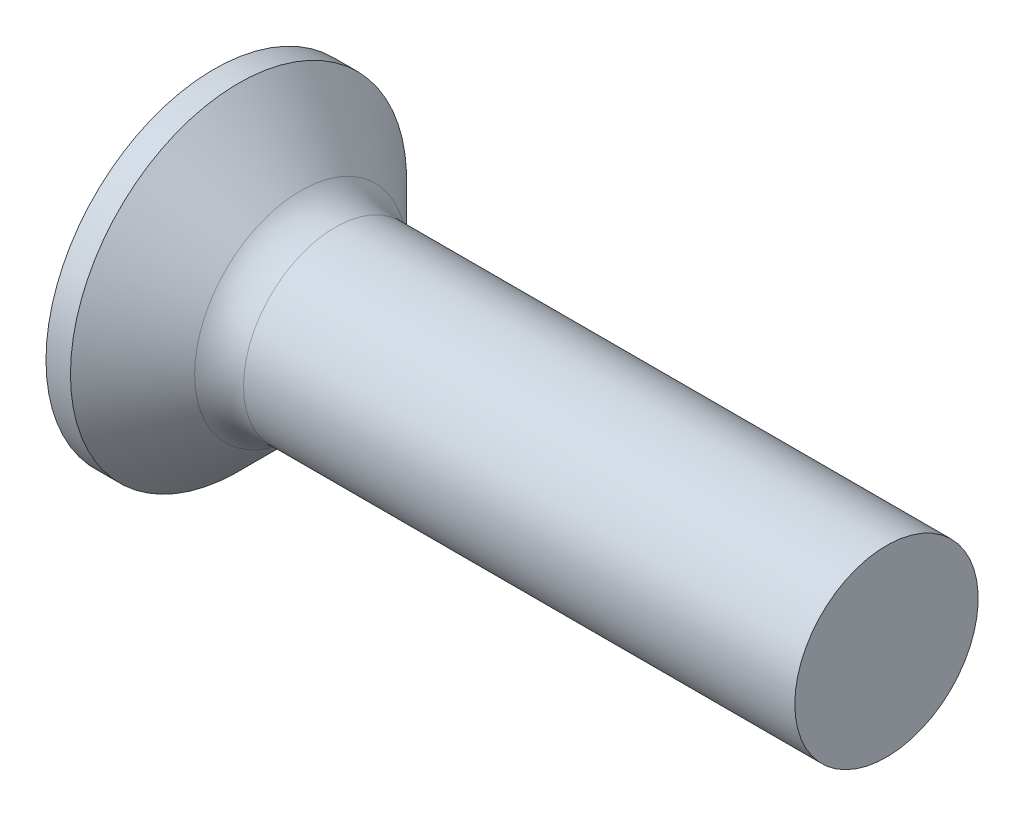
ISO-10303-21;
HEADER;
FILE_DESCRIPTION(('STEP AP214'),'2;1');
FILE_NAME('part.step','',(''),(''),'','','');
FILE_SCHEMA(('AUTOMOTIVE_DESIGN { 1 0 10303 214 1 1 1 1 }'));
ENDSEC;
DATA;
#1=APPLICATION_CONTEXT('core data for automotive mechanical design processes');
#2=APPLICATION_PROTOCOL_DEFINITION('international standard','automotive_design',2000,#1);
#3=PRODUCT_CONTEXT('',#1,'mechanical');
#4=PRODUCT('Part','Part','',(#3));
#5=PRODUCT_RELATED_PRODUCT_CATEGORY('part','',(#4));
#6=PRODUCT_DEFINITION_FORMATION('','',#4);
#7=PRODUCT_DEFINITION_CONTEXT('part definition',#1,'design');
#8=PRODUCT_DEFINITION('design','',#6,#7);
#9=PRODUCT_DEFINITION_SHAPE('','',#8);
#10=(LENGTH_UNIT() NAMED_UNIT(*) SI_UNIT(.MILLI.,.METRE.));
#11=(NAMED_UNIT(*) PLANE_ANGLE_UNIT() SI_UNIT($,.RADIAN.));
#12=(NAMED_UNIT(*) SI_UNIT($,.STERADIAN.) SOLID_ANGLE_UNIT());
#13=UNCERTAINTY_MEASURE_WITH_UNIT(LENGTH_MEASURE(1.E-05),#10,'distance_accuracy_value','');
#14=(GEOMETRIC_REPRESENTATION_CONTEXT(3) GLOBAL_UNCERTAINTY_ASSIGNED_CONTEXT((#13)) GLOBAL_UNIT_ASSIGNED_CONTEXT((#10,
#11,#12)) REPRESENTATION_CONTEXT('',''));
#15=CARTESIAN_POINT('',(0.,0.,0.));
#16=DIRECTION('',(0.,0.,1.));
#17=DIRECTION('',(1.,0.,0.));
#18=AXIS2_PLACEMENT_3D('',#15,#16,#17);
#19=CARTESIAN_POINT('',(2.01,-0.497851135403458,0.37));
#20=DIRECTION('',(0.,0.,-1.));
#21=DIRECTION('',(0.,1.,0.));
#22=AXIS2_PLACEMENT_3D('',#19,#20,#21);
#23=PLANE('',#22);
#24=DIRECTION('',(0.,-1.,0.));
#25=VECTOR('',#24,1.);
#26=CARTESIAN_POINT('',(0.,1.5,0.37));
#27=LINE('',#26,#25);
#28=CARTESIAN_POINT('',(0.,-0.590157547916263,0.37));
#29=VERTEX_POINT('',#28);
#30=CARTESIAN_POINT('',(0.,-1.5,0.37));
#31=VERTEX_POINT('',#30);
#32=EDGE_CURVE('E452',#29,#31,#27,.T.);
#33=ORIENTED_EDGE('',*,*,#32,.F.);
#34=CARTESIAN_POINT('',(-1.01053649691082,-0.672102030072118,0.37));
#35=CARTESIAN_POINT('',(-0.79970605871103,-0.655267098883947,0.37));
#36=CARTESIAN_POINT('',(-0.588886212503304,-0.638297110572311,0.37));
#37=CARTESIAN_POINT('',(-0.167272662529611,-0.603984130519828,0.37));
#38=CARTESIAN_POINT('',(0.0435210406290472,-0.586641131324258,0.37));
#39=CARTESIAN_POINT('',(0.465068838244709,-0.551479911667385,0.37));
#40=CARTESIAN_POINT('',(0.67582293271526,-0.533661691368909,0.37));
#41=CARTESIAN_POINT('',(1.09727362083221,-0.497387538872971,0.37));
#42=CARTESIAN_POINT('',(1.30797021521736,-0.478931615299089,0.37));
#43=CARTESIAN_POINT('',(1.67418894757201,-0.446067164121906,0.37));
#44=CARTESIAN_POINT('',(1.82972932585734,-0.431862501028414,0.37));
#45=CARTESIAN_POINT('',(2.14074770359484,-0.40279770973988,0.37));
#46=CARTESIAN_POINT('',(2.29622570356215,-0.38793758707517,0.37));
#47=CARTESIAN_POINT('',(2.60710169348415,-0.357305117937677,0.37));
#48=CARTESIAN_POINT('',(2.76249967840253,-0.34153271979064,0.37));
#49=CARTESIAN_POINT('',(2.99549070742189,-0.316847908281595,0.37));
#50=CARTESIAN_POINT('',(3.07313791118864,-0.308448465897182,0.37));
#51=CARTESIAN_POINT('',(3.22838341575769,-0.29120225104834,0.37));
#52=CARTESIAN_POINT('',(3.30598171599396,-0.282355473499083,0.37));
#53=CARTESIAN_POINT('',(3.38354828463398,-0.273232461289951,0.37));
#54=B_SPLINE_CURVE_WITH_KNOTS('',3,(#34,#35,#36,#37,#38,#39,#40,#41,#42,#43,#44,#45,#46,#47,#48,
#49,#50,#51,#52,#53),.UNSPECIFIED.,.F.,.F.,(4,2,2,2,2,2,2,2,2,4),(0.,0.634504777554397,
1.26902224766093,1.90353950036111,2.53804817592041,3.00661008438666,3.47516804019383,
3.94375256268972,4.17805198331268,4.41235406779909),.UNSPECIFIED.);
#55=CARTESIAN_POINT('',(2.01,-0.415013252800437,0.37));
#56=VERTEX_POINT('',#55);
#57=EDGE_CURVE('E215',#29,#56,#54,.T.);
#58=ORIENTED_EDGE('',*,*,#57,.T.);
#59=DIRECTION('',(0.,-1.,0.));
#60=VECTOR('',#59,1.);
#61=CARTESIAN_POINT('',(2.01,0.497851135403459,0.37));
#62=LINE('',#61,#60);
#63=CARTESIAN_POINT('',(2.01,-0.497851135403458,0.37));
#64=VERTEX_POINT('',#63);
#65=EDGE_CURVE('E361',#56,#64,#62,.T.);
#66=ORIENTED_EDGE('',*,*,#65,.T.);
#67=DIRECTION('',(0.894934391398442,0.446197753347436,0.));
#68=VECTOR('',#67,1.);
#69=CARTESIAN_POINT('',(0.,-1.5,0.37));
#70=LINE('',#69,#68);
#71=EDGE_CURVE('E460',#31,#64,#70,.T.);
#72=ORIENTED_EDGE('',*,*,#71,.F.);
#73=EDGE_LOOP('',(#33,#58,#66,#72));
#74=FACE_BOUND('',#73,.T.);
#75=ADVANCED_FACE('F37',(#74),#23,.T.);
#76=CARTESIAN_POINT('',(2.01,0.497851135403459,0.37));
#77=VERTEX_POINT('',#76);
#78=CARTESIAN_POINT('',(2.01,0.415013252800437,0.37));
#79=VERTEX_POINT('',#78);
#80=EDGE_CURVE('E357',#77,#79,#62,.T.);
#81=ORIENTED_EDGE('',*,*,#80,.T.);
#82=CARTESIAN_POINT('',(-1.01053649699026,0.672102030078459,0.37));
#83=CARTESIAN_POINT('',(-0.799706058781648,0.65526709888962,0.37));
#84=CARTESIAN_POINT('',(-0.588886212565099,0.638297110577309,0.37));
#85=CARTESIAN_POINT('',(-0.167272662573758,0.603984130523453,0.37));
#86=CARTESIAN_POINT('',(0.043521040593722,0.586641131327185,0.37));
#87=CARTESIAN_POINT('',(0.465068838236453,0.551479911668094,0.37));
#88=CARTESIAN_POINT('',(0.675822932725248,0.533661691368078,0.37));
#89=CARTESIAN_POINT('',(1.09727362087867,0.497387538868943,0.37));
#90=CARTESIAN_POINT('',(1.30797021528206,0.478931615293404,0.37));
#91=CARTESIAN_POINT('',(1.67418894765493,0.446067164114376,0.37));
#92=CARTESIAN_POINT('',(1.82972932594025,0.431862501020785,0.37));
#93=CARTESIAN_POINT('',(2.14074770367772,0.402797709732016,0.37));
#94=CARTESIAN_POINT('',(2.29622570364503,0.38793758706717,0.37));
#95=CARTESIAN_POINT('',(2.60710169356699,0.357305117929346,0.37));
#96=CARTESIAN_POINT('',(2.76249967848536,0.341532719782116,0.37));
#97=CARTESIAN_POINT('',(2.99549070750468,0.316847908272698,0.37));
#98=CARTESIAN_POINT('',(3.07313791127142,0.308448465888148,0.37));
#99=CARTESIAN_POINT('',(3.22838341584044,0.291202251038989,0.37));
#100=CARTESIAN_POINT('',(3.30598171607669,0.282355473489554,0.37));
#101=CARTESIAN_POINT('',(3.38354828471668,0.273232461280216,0.37));
#102=B_SPLINE_CURVE_WITH_KNOTS('',3,(#82,#83,#84,#85,#86,#87,#88,#89,#90,#91,#92,#93,#94,#95,
#96,#97,#98,#99,#100,#101),.UNSPECIFIED.,.F.,.F.,(4,2,2,2,2,2,2,2,2,4),(0.,0.634504777580945,
1.26902224771403,1.90353950046914,2.53804817608336,3.00661008454961,3.47516804035678,
3.94375256285268,4.17805198347564,4.41235406796206),.UNSPECIFIED.);
#103=CARTESIAN_POINT('',(0.,0.590157547916263,0.37));
#104=VERTEX_POINT('',#103);
#105=EDGE_CURVE('E209',#79,#104,#102,.F.);
#106=ORIENTED_EDGE('',*,*,#105,.T.);
#107=CARTESIAN_POINT('',(0.,1.5,0.37));
#108=VERTEX_POINT('',#107);
#109=EDGE_CURVE('E454',#108,#104,#27,.T.);
#110=ORIENTED_EDGE('',*,*,#109,.F.);
#111=DIRECTION('',(0.894934391398442,-0.446197753347436,0.));
#112=VECTOR('',#111,1.);
#113=CARTESIAN_POINT('',(0.,1.5,0.37));
#114=LINE('',#113,#112);
#115=EDGE_CURVE('E60',#108,#77,#114,.T.);
#116=ORIENTED_EDGE('',*,*,#115,.T.);
#117=EDGE_LOOP('',(#81,#106,#110,#116));
#118=FACE_BOUND('',#117,.T.);
#119=ADVANCED_FACE('F191',(#118),#23,.T.);
#120=CARTESIAN_POINT('',(2.01,0.497851135403458,-0.37));
#121=DIRECTION('',(0.,0.,1.));
#122=DIRECTION('',(1.,0.,0.));
#123=AXIS2_PLACEMENT_3D('',#120,#121,#122);
#124=PLANE('',#123);
#125=DIRECTION('',(0.,1.,0.));
#126=VECTOR('',#125,1.);
#127=CARTESIAN_POINT('',(2.01,-0.497851135403458,-0.37));
#128=LINE('',#127,#126);
#129=CARTESIAN_POINT('',(2.01,-0.497851135403458,-0.37));
#130=VERTEX_POINT('',#129);
#131=CARTESIAN_POINT('',(2.01,-0.415013252800437,-0.37));
#132=VERTEX_POINT('',#131);
#133=EDGE_CURVE('E370',#130,#132,#128,.T.);
#134=ORIENTED_EDGE('',*,*,#133,.T.);
#135=CARTESIAN_POINT('',(-1.01053649691082,-0.672102030072118,-0.37));
#136=CARTESIAN_POINT('',(-0.79970605871103,-0.655267098883947,-0.37));
#137=CARTESIAN_POINT('',(-0.588886212503305,-0.638297110572311,-0.37));
#138=CARTESIAN_POINT('',(-0.16727266252961,-0.603984130519828,-0.37));
#139=CARTESIAN_POINT('',(0.0435210406290472,-0.586641131324259,-0.37));
#140=CARTESIAN_POINT('',(0.465068838244709,-0.551479911667385,-0.37));
#141=CARTESIAN_POINT('',(0.67582293271526,-0.533661691368909,-0.37));
#142=CARTESIAN_POINT('',(1.09727362083221,-0.497387538872971,-0.37));
#143=CARTESIAN_POINT('',(1.30797021521736,-0.47893161529909,-0.37));
#144=CARTESIAN_POINT('',(1.67418894757201,-0.446067164121906,-0.37));
#145=CARTESIAN_POINT('',(1.82972932585734,-0.431862501028414,-0.37));
#146=CARTESIAN_POINT('',(2.14074770359484,-0.40279770973988,-0.37));
#147=CARTESIAN_POINT('',(2.29622570356215,-0.38793758707517,-0.37));
#148=CARTESIAN_POINT('',(2.60710169348415,-0.357305117937677,-0.37));
#149=CARTESIAN_POINT('',(2.76249967840254,-0.34153271979064,-0.37));
#150=CARTESIAN_POINT('',(2.99549070742189,-0.316847908281595,-0.37));
#151=CARTESIAN_POINT('',(3.07313791118864,-0.308448465897182,-0.37));
#152=CARTESIAN_POINT('',(3.22838341575769,-0.29120225104834,-0.37));
#153=CARTESIAN_POINT('',(3.30598171599396,-0.282355473499083,-0.37));
#154=CARTESIAN_POINT('',(3.38354828463398,-0.273232461289951,-0.37));
#155=B_SPLINE_CURVE_WITH_KNOTS('',3,(#135,#136,#137,#138,#139,#140,#141,#142,#143,#144,#145,
#146,#147,#148,#149,#150,#151,#152,#153,#154),.UNSPECIFIED.,.F.,.F.,(4,2,2,2,2,2,2,2,2,4),(0.,
0.634504777554397,1.26902224766093,1.90353950036111,2.53804817592041,3.00661008438666,
3.47516804019383,3.94375256268973,4.17805198331268,4.41235406779909),.UNSPECIFIED.);
#156=CARTESIAN_POINT('',(0.,-0.590157547916263,-0.37));
#157=VERTEX_POINT('',#156);
#158=EDGE_CURVE('E265',#132,#157,#155,.F.);
#159=ORIENTED_EDGE('',*,*,#158,.T.);
#160=DIRECTION('',(0.,1.,0.));
#161=VECTOR('',#160,1.);
#162=CARTESIAN_POINT('',(0.,-1.5,-0.37));
#163=LINE('',#162,#161);
#164=CARTESIAN_POINT('',(0.,-1.5,-0.37));
#165=VERTEX_POINT('',#164);
#166=EDGE_CURVE('E453',#165,#157,#163,.T.);
#167=ORIENTED_EDGE('',*,*,#166,.F.);
#168=DIRECTION('',(0.894934391398442,0.446197753347436,0.));
#169=VECTOR('',#168,1.);
#170=CARTESIAN_POINT('',(0.,-1.5,-0.37));
#171=LINE('',#170,#169);
#172=EDGE_CURVE('E463',#165,#130,#171,.T.);
#173=ORIENTED_EDGE('',*,*,#172,.T.);
#174=EDGE_LOOP('',(#134,#159,#167,#173));
#175=FACE_BOUND('',#174,.T.);
#176=ADVANCED_FACE('F197',(#175),#124,.T.);
#177=CARTESIAN_POINT('',(0.,0.590157547916263,-0.37));
#178=VERTEX_POINT('',#177);
#179=CARTESIAN_POINT('',(0.,1.5,-0.37));
#180=VERTEX_POINT('',#179);
#181=EDGE_CURVE('E459',#178,#180,#163,.T.);
#182=ORIENTED_EDGE('',*,*,#181,.F.);
#183=CARTESIAN_POINT('',(-1.01053649691082,0.672102030072118,-0.37));
#184=CARTESIAN_POINT('',(-0.79970605871103,0.655267098883947,-0.37));
#185=CARTESIAN_POINT('',(-0.588886212503304,0.638297110572311,-0.37));
#186=CARTESIAN_POINT('',(-0.16727266252961,0.603984130519828,-0.37));
#187=CARTESIAN_POINT('',(0.0435210406290473,0.586641131324259,-0.37));
#188=CARTESIAN_POINT('',(0.465068838244709,0.551479911667385,-0.37));
#189=CARTESIAN_POINT('',(0.67582293271526,0.533661691368909,-0.37));
#190=CARTESIAN_POINT('',(1.09727362083221,0.497387538872971,-0.37));
#191=CARTESIAN_POINT('',(1.30797021521736,0.478931615299089,-0.37));
#192=CARTESIAN_POINT('',(1.67418894757201,0.446067164121906,-0.37));
#193=CARTESIAN_POINT('',(1.82972932585734,0.431862501028415,-0.37));
#194=CARTESIAN_POINT('',(2.14074770359484,0.40279770973988,-0.37));
#195=CARTESIAN_POINT('',(2.29622570356215,0.38793758707517,-0.37));
#196=CARTESIAN_POINT('',(2.60710169348415,0.357305117937677,-0.37));
#197=CARTESIAN_POINT('',(2.76249967840253,0.34153271979064,-0.37));
#198=CARTESIAN_POINT('',(2.99549070742189,0.316847908281595,-0.37));
#199=CARTESIAN_POINT('',(3.07313791118864,0.308448465897183,-0.37));
#200=CARTESIAN_POINT('',(3.22838341575769,0.29120225104834,-0.37));
#201=CARTESIAN_POINT('',(3.30598171599396,0.282355473499083,-0.37));
#202=CARTESIAN_POINT('',(3.38354828463398,0.273232461289951,-0.37));
#203=B_SPLINE_CURVE_WITH_KNOTS('',3,(#183,#184,#185,#186,#187,#188,#189,#190,#191,#192,#193,
#194,#195,#196,#197,#198,#199,#200,#201,#202),.UNSPECIFIED.,.F.,.F.,(4,2,2,2,2,2,2,2,2,4),(0.,
0.634504777554397,1.26902224766093,1.90353950036111,2.53804817592041,3.00661008438666,
3.47516804019383,3.94375256268972,4.17805198331267,4.41235406779909),.UNSPECIFIED.);
#204=CARTESIAN_POINT('',(2.01,0.415013252800437,-0.37));
#205=VERTEX_POINT('',#204);
#206=EDGE_CURVE('E260',#178,#205,#203,.T.);
#207=ORIENTED_EDGE('',*,*,#206,.T.);
#208=CARTESIAN_POINT('',(2.01,0.497851135403459,-0.37));
#209=VERTEX_POINT('',#208);
#210=EDGE_CURVE('E372',#205,#209,#128,.T.);
#211=ORIENTED_EDGE('',*,*,#210,.T.);
#212=DIRECTION('',(0.894934391398442,-0.446197753347436,0.));
#213=VECTOR('',#212,1.);
#214=CARTESIAN_POINT('',(0.,1.5,-0.37));
#215=LINE('',#214,#213);
#216=EDGE_CURVE('E369',#180,#209,#215,.T.);
#217=ORIENTED_EDGE('',*,*,#216,.F.);
#218=EDGE_LOOP('',(#182,#207,#211,#217));
#219=FACE_BOUND('',#218,.T.);
#220=ADVANCED_FACE('F470',(#219),#124,.T.);
#221=CARTESIAN_POINT('',(2.01,0.497851135403459,-0.37));
#222=DIRECTION('',(1.,0.,0.));
#223=DIRECTION('',(0.,0.,-1.));
#224=AXIS2_PLACEMENT_3D('',#221,#222,#223);
#225=PLANE('',#224);
#226=CARTESIAN_POINT('',(2.01,0.,0.));
#227=DIRECTION('',(-1.,0.,0.));
#228=DIRECTION('',(0.,0.,1.));
#229=AXIS2_PLACEMENT_3D('',#226,#227,#228);
#230=CIRCLE('',#229,0.555999999999999);
#231=CARTESIAN_POINT('',(2.01,-0.24754847399547,-0.497851135403459));
#232=VERTEX_POINT('',#231);
#233=CARTESIAN_POINT('',(2.01,-0.369999999999999,-0.415013252800438));
#234=VERTEX_POINT('',#233);
#235=EDGE_CURVE('E336',#232,#234,#230,.T.);
#236=ORIENTED_EDGE('',*,*,#235,.F.);
#237=DIRECTION('',(0.,1.,0.));
#238=VECTOR('',#237,1.);
#239=CARTESIAN_POINT('',(2.01,-0.369999999999998,-0.49785113540346));
#240=LINE('',#239,#238);
#241=CARTESIAN_POINT('',(2.01,-0.369999999999998,-0.49785113540346));
#242=VERTEX_POINT('',#241);
#243=EDGE_CURVE('E437',#242,#232,#240,.T.);
#244=ORIENTED_EDGE('',*,*,#243,.F.);
#245=DIRECTION('',(0.,0.,-1.));
#246=VECTOR('',#245,1.);
#247=CARTESIAN_POINT('',(2.01,-0.370000000000002,0.497851135403457));
#248=LINE('',#247,#246);
#249=EDGE_CURVE('E441',#234,#242,#248,.T.);
#250=ORIENTED_EDGE('',*,*,#249,.F.);
#251=EDGE_LOOP('',(#236,#244,#250));
#252=FACE_BOUND('',#251,.T.);
#253=ADVANCED_FACE('F483',(#252),#225,.F.);
#254=CARTESIAN_POINT('',(2.01,-0.497851135403458,-0.247548473995472));
#255=VERTEX_POINT('',#254);
#256=EDGE_CURVE('E331',#132,#255,#230,.T.);
#257=ORIENTED_EDGE('',*,*,#256,.F.);
#258=ORIENTED_EDGE('',*,*,#133,.F.);
#259=DIRECTION('',(0.,0.,-1.));
#260=VECTOR('',#259,1.);
#261=CARTESIAN_POINT('',(2.01,-0.497851135403458,0.37));
#262=LINE('',#261,#260);
#263=EDGE_CURVE('E360',#255,#130,#262,.T.);
#264=ORIENTED_EDGE('',*,*,#263,.F.);
#265=EDGE_LOOP('',(#257,#258,#264));
#266=FACE_BOUND('',#265,.T.);
#267=ADVANCED_FACE('F489',(#266),#225,.F.);
#268=CARTESIAN_POINT('',(2.01,-0.497851135403458,0.247548473995472));
#269=VERTEX_POINT('',#268);
#270=EDGE_CURVE('E326',#269,#56,#230,.T.);
#271=ORIENTED_EDGE('',*,*,#270,.F.);
#272=EDGE_CURVE('E363',#64,#269,#262,.T.);
#273=ORIENTED_EDGE('',*,*,#272,.F.);
#274=ORIENTED_EDGE('',*,*,#65,.F.);
#275=EDGE_LOOP('',(#271,#273,#274));
#276=FACE_BOUND('',#275,.T.);
#277=ADVANCED_FACE('F495',(#276),#225,.F.);
#278=CARTESIAN_POINT('',(2.01,-0.370000000000001,0.415013252800436));
#279=VERTEX_POINT('',#278);
#280=CARTESIAN_POINT('',(2.01,-0.247548473995473,0.497851135403458));
#281=VERTEX_POINT('',#280);
#282=EDGE_CURVE('E52',#279,#281,#230,.T.);
#283=ORIENTED_EDGE('',*,*,#282,.F.);
#284=CARTESIAN_POINT('',(2.01,-0.370000000000002,0.497851135403457));
#285=VERTEX_POINT('',#284);
#286=EDGE_CURVE('E443',#285,#279,#248,.T.);
#287=ORIENTED_EDGE('',*,*,#286,.F.);
#288=DIRECTION('',(0.,-1.,0.));
#289=VECTOR('',#288,1.);
#290=CARTESIAN_POINT('',(2.01,0.369999999999998,0.49785113540346));
#291=LINE('',#290,#289);
#292=EDGE_CURVE('E442',#281,#285,#291,.T.);
#293=ORIENTED_EDGE('',*,*,#292,.F.);
#294=EDGE_LOOP('',(#283,#287,#293));
#295=FACE_BOUND('',#294,.T.);
#296=ADVANCED_FACE('F522',(#295),#225,.F.);
#297=CARTESIAN_POINT('',(2.01,0.24754847399547,0.497851135403459));
#298=VERTEX_POINT('',#297);
#299=CARTESIAN_POINT('',(2.01,0.369999999999999,0.415013252800438));
#300=VERTEX_POINT('',#299);
#301=EDGE_CURVE('E317',#298,#300,#230,.T.);
#302=ORIENTED_EDGE('',*,*,#301,.F.);
#303=CARTESIAN_POINT('',(2.01,0.369999999999998,0.49785113540346));
#304=VERTEX_POINT('',#303);
#305=EDGE_CURVE('E438',#304,#298,#291,.T.);
#306=ORIENTED_EDGE('',*,*,#305,.F.);
#307=DIRECTION('',(0.,0.,1.));
#308=VECTOR('',#307,1.);
#309=CARTESIAN_POINT('',(2.01,0.370000000000002,-0.497851135403457));
#310=LINE('',#309,#308);
#311=EDGE_CURVE('E221',#300,#304,#310,.T.);
#312=ORIENTED_EDGE('',*,*,#311,.F.);
#313=EDGE_LOOP('',(#302,#306,#312));
#314=FACE_BOUND('',#313,.T.);
#315=ADVANCED_FACE('F479',(#314),#225,.F.);
#316=CARTESIAN_POINT('',(2.01,0.497851135403459,0.247548473995472));
#317=VERTEX_POINT('',#316);
#318=EDGE_CURVE('E324',#79,#317,#230,.T.);
#319=ORIENTED_EDGE('',*,*,#318,.F.);
#320=ORIENTED_EDGE('',*,*,#80,.F.);
#321=DIRECTION('',(0.,0.,1.));
#322=VECTOR('',#321,1.);
#323=CARTESIAN_POINT('',(2.01,0.497851135403459,-0.37));
#324=LINE('',#323,#322);
#325=EDGE_CURVE('E358',#317,#77,#324,.T.);
#326=ORIENTED_EDGE('',*,*,#325,.F.);
#327=EDGE_LOOP('',(#319,#320,#326));
#328=FACE_BOUND('',#327,.T.);
#329=ADVANCED_FACE('F356',(#328),#225,.F.);
#330=CARTESIAN_POINT('',(2.01,0.497851135403459,-0.247548473995472));
#331=VERTEX_POINT('',#330);
#332=EDGE_CURVE('E346',#331,#205,#230,.T.);
#333=ORIENTED_EDGE('',*,*,#332,.F.);
#334=EDGE_CURVE('E365',#209,#331,#324,.T.);
#335=ORIENTED_EDGE('',*,*,#334,.F.);
#336=ORIENTED_EDGE('',*,*,#210,.F.);
#337=EDGE_LOOP('',(#333,#335,#336));
#338=FACE_BOUND('',#337,.T.);
#339=ADVANCED_FACE('F472',(#338),#225,.F.);
#340=CARTESIAN_POINT('',(2.01,-0.497851135403458,-0.37));
#341=DIRECTION('',(-0.446197753347436,0.894934391398443,0.));
#342=DIRECTION('',(-0.894934391398442,-0.446197753347436,0.));
#343=AXIS2_PLACEMENT_3D('',#340,#341,#342);
#344=PLANE('',#343);
#345=ORIENTED_EDGE('',*,*,#272,.T.);
#346=CARTESIAN_POINT('',(2.86902919914418,-0.0695550475538963,0.));
#347=DIRECTION('',(-0.446197753347436,0.894934391398443,0.));
#348=DIRECTION('',(-0.894934391398443,-0.446197753347436,0.));
#349=AXIS2_PLACEMENT_3D('',#346,#347,#348);
#350=ELLIPSE('',#349,1.11145971268776,0.491029001453358);
#351=EDGE_CURVE('E276',#269,#255,#350,.F.);
#352=ORIENTED_EDGE('',*,*,#351,.T.);
#353=ORIENTED_EDGE('',*,*,#263,.T.);
#354=ORIENTED_EDGE('',*,*,#172,.F.);
#355=DIRECTION('',(0.,0.,-1.));
#356=VECTOR('',#355,1.);
#357=CARTESIAN_POINT('',(0.,-1.5,0.37));
#358=LINE('',#357,#356);
#359=EDGE_CURVE('E377',#31,#165,#358,.T.);
#360=ORIENTED_EDGE('',*,*,#359,.F.);
#361=ORIENTED_EDGE('',*,*,#71,.T.);
#362=EDGE_LOOP('',(#345,#352,#353,#354,#360,#361));
#363=FACE_BOUND('',#362,.T.);
#364=ADVANCED_FACE('F203',(#363),#344,.T.);
#365=CARTESIAN_POINT('',(2.01,0.497851135403459,0.37));
#366=DIRECTION('',(-0.446197753347436,-0.894934391398443,0.));
#367=DIRECTION('',(0.894934391398442,-0.446197753347436,0.));
#368=AXIS2_PLACEMENT_3D('',#365,#366,#367);
#369=PLANE('',#368);
#370=ORIENTED_EDGE('',*,*,#334,.T.);
#371=CARTESIAN_POINT('',(2.86902919914418,0.0695550475538964,0.));
#372=DIRECTION('',(-0.446197753347436,-0.894934391398443,0.));
#373=DIRECTION('',(-0.894934391398443,0.446197753347436,0.));
#374=AXIS2_PLACEMENT_3D('',#371,#372,#373);
#375=ELLIPSE('',#374,1.11145971268776,0.491029001453358);
#376=EDGE_CURVE('E281',#331,#317,#375,.F.);
#377=ORIENTED_EDGE('',*,*,#376,.T.);
#378=ORIENTED_EDGE('',*,*,#325,.T.);
#379=ORIENTED_EDGE('',*,*,#115,.F.);
#380=DIRECTION('',(0.,0.,1.));
#381=VECTOR('',#380,1.);
#382=CARTESIAN_POINT('',(0.,1.5,-0.37));
#383=LINE('',#382,#381);
#384=EDGE_CURVE('E449',#180,#108,#383,.T.);
#385=ORIENTED_EDGE('',*,*,#384,.F.);
#386=ORIENTED_EDGE('',*,*,#216,.T.);
#387=EDGE_LOOP('',(#370,#377,#378,#379,#385,#386));
#388=FACE_BOUND('',#387,.T.);
#389=ADVANCED_FACE('F468',(#388),#369,.T.);
#390=CARTESIAN_POINT('',(2.01,0.369999999999998,0.497851135403459));
#391=DIRECTION('',(0.,-1.,0.));
#392=DIRECTION('',(1.,0.,0.));
#393=AXIS2_PLACEMENT_3D('',#390,#391,#392);
#394=PLANE('',#393);
#395=CARTESIAN_POINT('',(2.01,0.370000000000002,-0.497851135403457));
#396=VERTEX_POINT('',#395);
#397=CARTESIAN_POINT('',(2.01,0.370000000000001,-0.415013252800436));
#398=VERTEX_POINT('',#397);
#399=EDGE_CURVE('E447',#396,#398,#310,.T.);
#400=ORIENTED_EDGE('',*,*,#399,.T.);
#401=CARTESIAN_POINT('',(-1.01053649699026,0.370000000000002,-0.672102030078458));
#402=CARTESIAN_POINT('',(-0.799706058781648,0.370000000000002,-0.655267098889619));
#403=CARTESIAN_POINT('',(-0.588886212565099,0.370000000000002,-0.638297110577308));
#404=CARTESIAN_POINT('',(-0.167272662573758,0.370000000000002,-0.603984130523452));
#405=CARTESIAN_POINT('',(0.0435210405937218,0.370000000000002,-0.586641131327184));
#406=CARTESIAN_POINT('',(0.465068838236452,0.370000000000002,-0.551479911668093));
#407=CARTESIAN_POINT('',(0.675822932725247,0.370000000000002,-0.533661691368077));
#408=CARTESIAN_POINT('',(1.09727362087867,0.370000000000002,-0.497387538868942));
#409=CARTESIAN_POINT('',(1.30797021528206,0.370000000000002,-0.478931615293403));
#410=CARTESIAN_POINT('',(1.67418894765493,0.370000000000001,-0.446067164114375));
#411=CARTESIAN_POINT('',(1.82972932594025,0.370000000000001,-0.431862501020784));
#412=CARTESIAN_POINT('',(2.14074770367772,0.370000000000001,-0.402797709732014));
#413=CARTESIAN_POINT('',(2.29622570364503,0.370000000000001,-0.387937587067169));
#414=CARTESIAN_POINT('',(2.60710169356699,0.370000000000001,-0.357305117929345));
#415=CARTESIAN_POINT('',(2.76249967848536,0.370000000000001,-0.341532719782114));
#416=CARTESIAN_POINT('',(2.99549070750468,0.370000000000001,-0.316847908272697));
#417=CARTESIAN_POINT('',(3.07313791127142,0.370000000000001,-0.308448465888147));
#418=CARTESIAN_POINT('',(3.22838341584044,0.370000000000001,-0.291202251038988));
#419=CARTESIAN_POINT('',(3.30598171607669,0.370000000000001,-0.282355473489552));
#420=CARTESIAN_POINT('',(3.38354828471668,0.370000000000001,-0.273232461280215));
#421=B_SPLINE_CURVE_WITH_KNOTS('',3,(#401,#402,#403,#404,#405,#406,#407,#408,#409,#410,#411,
#412,#413,#414,#415,#416,#417,#418,#419,#420),.UNSPECIFIED.,.F.,.F.,(4,2,2,2,2,2,2,2,2,4),(0.,
0.634504777580945,1.26902224771403,1.90353950046914,2.53804817608336,3.00661008454961,
3.47516804035678,3.94375256285268,4.17805198347564,4.41235406796206),.UNSPECIFIED.);
#422=CARTESIAN_POINT('',(0.,0.370000000000002,-0.590157547916262));
#423=VERTEX_POINT('',#422);
#424=EDGE_CURVE('E253',#398,#423,#421,.F.);
#425=ORIENTED_EDGE('',*,*,#424,.T.);
#426=DIRECTION('',(0.,0.,1.));
#427=VECTOR('',#426,1.);
#428=CARTESIAN_POINT('',(0.,0.370000000000005,-1.5));
#429=LINE('',#428,#427);
#430=CARTESIAN_POINT('',(0.,0.370000000000005,-1.5));
#431=VERTEX_POINT('',#430);
#432=EDGE_CURVE('E423',#431,#423,#429,.T.);
#433=ORIENTED_EDGE('',*,*,#432,.F.);
#434=DIRECTION('',(0.894934391398442,0.,0.446197753347436));
#435=VECTOR('',#434,1.);
#436=CARTESIAN_POINT('',(0.,0.370000000000005,-1.5));
#437=LINE('',#436,#435);
#438=EDGE_CURVE('E429',#431,#396,#437,.T.);
#439=ORIENTED_EDGE('',*,*,#438,.T.);
#440=EDGE_LOOP('',(#400,#425,#433,#439));
#441=FACE_BOUND('',#440,.T.);
#442=ADVANCED_FACE('F602',(#441),#394,.T.);
#443=CARTESIAN_POINT('',(2.01,-0.369999999999998,-0.497851135403459));
#444=DIRECTION('',(0.,1.,0.));
#445=DIRECTION('',(0.,0.,1.));
#446=AXIS2_PLACEMENT_3D('',#443,#444,#445);
#447=PLANE('',#446);
#448=DIRECTION('',(0.,0.,-1.));
#449=VECTOR('',#448,1.);
#450=CARTESIAN_POINT('',(0.,-0.370000000000005,1.5));
#451=LINE('',#450,#449);
#452=CARTESIAN_POINT('',(0.,-0.369999999999998,-0.590157547916264));
#453=VERTEX_POINT('',#452);
#454=CARTESIAN_POINT('',(0.,-0.369999999999995,-1.5));
#455=VERTEX_POINT('',#454);
#456=EDGE_CURVE('E419',#453,#455,#451,.T.);
#457=ORIENTED_EDGE('',*,*,#456,.F.);
#458=CARTESIAN_POINT('',(-1.01053649699026,-0.369999999999998,-0.67210203007846));
#459=CARTESIAN_POINT('',(-0.799706058781648,-0.369999999999998,-0.655267098889622));
#460=CARTESIAN_POINT('',(-0.588886212565099,-0.369999999999998,-0.638297110577311));
#461=CARTESIAN_POINT('',(-0.167272662573759,-0.369999999999998,-0.603984130523454));
#462=CARTESIAN_POINT('',(0.0435210405937218,-0.369999999999998,-0.586641131327186));
#463=CARTESIAN_POINT('',(0.465068838236453,-0.369999999999998,-0.551479911668095));
#464=CARTESIAN_POINT('',(0.675822932725248,-0.369999999999998,-0.53366169136808));
#465=CARTESIAN_POINT('',(1.09727362087867,-0.369999999999998,-0.497387538868944));
#466=CARTESIAN_POINT('',(1.30797021528206,-0.369999999999998,-0.478931615293405));
#467=CARTESIAN_POINT('',(1.67418894765493,-0.369999999999999,-0.446067164114377));
#468=CARTESIAN_POINT('',(1.82972932594025,-0.369999999999999,-0.431862501020786));
#469=CARTESIAN_POINT('',(2.14074770367772,-0.369999999999999,-0.402797709732017));
#470=CARTESIAN_POINT('',(2.29622570364503,-0.369999999999999,-0.387937587067171));
#471=CARTESIAN_POINT('',(2.60710169356699,-0.369999999999999,-0.357305117929348));
#472=CARTESIAN_POINT('',(2.76249967848536,-0.369999999999999,-0.341532719782117));
#473=CARTESIAN_POINT('',(2.99549070750468,-0.369999999999999,-0.316847908272699));
#474=CARTESIAN_POINT('',(3.07313791127142,-0.369999999999999,-0.30844846588815));
#475=CARTESIAN_POINT('',(3.22838341584044,-0.369999999999999,-0.291202251038991));
#476=CARTESIAN_POINT('',(3.30598171607669,-0.369999999999999,-0.282355473489555));
#477=CARTESIAN_POINT('',(3.38354828471668,-0.369999999999999,-0.273232461280217));
#478=B_SPLINE_CURVE_WITH_KNOTS('',3,(#458,#459,#460,#461,#462,#463,#464,#465,#466,#467,#468,
#469,#470,#471,#472,#473,#474,#475,#476,#477),.UNSPECIFIED.,.F.,.F.,(4,2,2,2,2,2,2,2,2,4),(0.,
0.634504777580943,1.26902224771403,1.90353950046914,2.53804817608336,3.00661008454961,
3.47516804035678,3.94375256285268,4.17805198347564,4.41235406796206),.UNSPECIFIED.);
#479=EDGE_CURVE('E247',#453,#234,#478,.T.);
#480=ORIENTED_EDGE('',*,*,#479,.T.);
#481=ORIENTED_EDGE('',*,*,#249,.T.);
#482=DIRECTION('',(0.894934391398442,0.,0.446197753347436));
#483=VECTOR('',#482,1.);
#484=CARTESIAN_POINT('',(0.,-0.369999999999995,-1.5));
#485=LINE('',#484,#483);
#486=EDGE_CURVE('E426',#455,#242,#485,.T.);
#487=ORIENTED_EDGE('',*,*,#486,.F.);
#488=EDGE_LOOP('',(#457,#480,#481,#487));
#489=FACE_BOUND('',#488,.T.);
#490=ADVANCED_FACE('F500',(#489),#447,.T.);
#491=CARTESIAN_POINT('',(2.01,0.370000000000002,-0.497851135403457));
#492=DIRECTION('',(-0.446197753347436,0.,0.894934391398443));
#493=DIRECTION('',(-0.894934391398442,0.,-0.446197753347436));
#494=AXIS2_PLACEMENT_3D('',#491,#492,#493);
#495=PLANE('',#494);
#496=ORIENTED_EDGE('',*,*,#243,.T.);
#497=CARTESIAN_POINT('',(2.86902919914418,0.,-0.0695550475538964));
#498=DIRECTION('',(-0.446197753347436,0.,0.894934391398443));
#499=DIRECTION('',(-0.894934391398443,0.,-0.446197753347436));
#500=AXIS2_PLACEMENT_3D('',#497,#498,#499);
#501=ELLIPSE('',#500,1.11145971268776,0.491029001453358);
#502=CARTESIAN_POINT('',(2.01,0.247548473995474,-0.497851135403457));
#503=VERTEX_POINT('',#502);
#504=EDGE_CURVE('E294',#232,#503,#501,.F.);
#505=ORIENTED_EDGE('',*,*,#504,.T.);
#506=EDGE_CURVE('E445',#503,#396,#240,.T.);
#507=ORIENTED_EDGE('',*,*,#506,.T.);
#508=ORIENTED_EDGE('',*,*,#438,.F.);
#509=DIRECTION('',(0.,1.,0.));
#510=VECTOR('',#509,1.);
#511=CARTESIAN_POINT('',(0.,-0.369999999999995,-1.5));
#512=LINE('',#511,#510);
#513=EDGE_CURVE('E418',#455,#431,#512,.T.);
#514=ORIENTED_EDGE('',*,*,#513,.F.);
#515=ORIENTED_EDGE('',*,*,#486,.T.);
#516=EDGE_LOOP('',(#496,#505,#507,#508,#514,#515));
#517=FACE_BOUND('',#516,.T.);
#518=ADVANCED_FACE('F226',(#517),#495,.T.);
#519=ORIENTED_EDGE('',*,*,#286,.T.);
#520=CARTESIAN_POINT('',(-1.01053649699026,-0.370000000000002,0.672102030078458));
#521=CARTESIAN_POINT('',(-0.799706058781648,-0.370000000000002,0.655267098889619));
#522=CARTESIAN_POINT('',(-0.588886212565099,-0.370000000000002,0.638297110577308));
#523=CARTESIAN_POINT('',(-0.167272662573758,-0.370000000000002,0.603984130523451));
#524=CARTESIAN_POINT('',(0.0435210405937218,-0.370000000000002,0.586641131327183));
#525=CARTESIAN_POINT('',(0.465068838236452,-0.370000000000002,0.551479911668093));
#526=CARTESIAN_POINT('',(0.675822932725247,-0.370000000000002,0.533661691368077));
#527=CARTESIAN_POINT('',(1.09727362087867,-0.370000000000002,0.497387538868942));
#528=CARTESIAN_POINT('',(1.30797021528206,-0.370000000000002,0.478931615293403));
#529=CARTESIAN_POINT('',(1.67418894765493,-0.370000000000002,0.446067164114375));
#530=CARTESIAN_POINT('',(1.82972932594025,-0.370000000000001,0.431862501020784));
#531=CARTESIAN_POINT('',(2.14074770367772,-0.370000000000001,0.402797709732014));
#532=CARTESIAN_POINT('',(2.29622570364503,-0.370000000000001,0.387937587067169));
#533=CARTESIAN_POINT('',(2.60710169356699,-0.370000000000001,0.357305117929345));
#534=CARTESIAN_POINT('',(2.76249967848536,-0.370000000000001,0.341532719782114));
#535=CARTESIAN_POINT('',(2.99549070750468,-0.370000000000001,0.316847908272697));
#536=CARTESIAN_POINT('',(3.07313791127142,-0.370000000000001,0.308448465888147));
#537=CARTESIAN_POINT('',(3.22838341584044,-0.370000000000001,0.291202251038988));
#538=CARTESIAN_POINT('',(3.30598171607669,-0.370000000000001,0.282355473489552));
#539=CARTESIAN_POINT('',(3.38354828471668,-0.370000000000001,0.273232461280214));
#540=B_SPLINE_CURVE_WITH_KNOTS('',3,(#520,#521,#522,#523,#524,#525,#526,#527,#528,#529,#530,
#531,#532,#533,#534,#535,#536,#537,#538,#539),.UNSPECIFIED.,.F.,.F.,(4,2,2,2,2,2,2,2,2,4),(0.,
0.634504777580945,1.26902224771403,1.90353950046914,2.53804817608336,3.00661008454961,
3.47516804035678,3.94375256285268,4.17805198347564,4.41235406796206),.UNSPECIFIED.);
#541=CARTESIAN_POINT('',(0.,-0.370000000000002,0.590157547916262));
#542=VERTEX_POINT('',#541);
#543=EDGE_CURVE('E240',#279,#542,#540,.F.);
#544=ORIENTED_EDGE('',*,*,#543,.T.);
#545=CARTESIAN_POINT('',(0.,-0.370000000000005,1.5));
#546=VERTEX_POINT('',#545);
#547=EDGE_CURVE('E414',#546,#542,#451,.T.);
#548=ORIENTED_EDGE('',*,*,#547,.F.);
#549=DIRECTION('',(0.894934391398442,0.,-0.446197753347436));
#550=VECTOR('',#549,1.);
#551=CARTESIAN_POINT('',(0.,-0.370000000000005,1.5));
#552=LINE('',#551,#550);
#553=EDGE_CURVE('E432',#546,#285,#552,.T.);
#554=ORIENTED_EDGE('',*,*,#553,.T.);
#555=EDGE_LOOP('',(#519,#544,#548,#554));
#556=FACE_BOUND('',#555,.T.);
#557=ADVANCED_FACE('F520',(#556),#447,.T.);
#558=CARTESIAN_POINT('',(0.,0.369999999999998,0.590157547916264));
#559=VERTEX_POINT('',#558);
#560=CARTESIAN_POINT('',(0.,0.369999999999995,1.5));
#561=VERTEX_POINT('',#560);
#562=EDGE_CURVE('E425',#559,#561,#429,.T.);
#563=ORIENTED_EDGE('',*,*,#562,.F.);
#564=CARTESIAN_POINT('',(-1.01053649699026,0.369999999999997,0.67210203007846));
#565=CARTESIAN_POINT('',(-0.799706058781648,0.369999999999998,0.655267098889622));
#566=CARTESIAN_POINT('',(-0.588886212565098,0.369999999999998,0.638297110577311));
#567=CARTESIAN_POINT('',(-0.167272662573758,0.369999999999998,0.603984130523454));
#568=CARTESIAN_POINT('',(0.0435210405937221,0.369999999999998,0.586641131327186));
#569=CARTESIAN_POINT('',(0.465068838236453,0.369999999999998,0.551479911668096));
#570=CARTESIAN_POINT('',(0.675822932725248,0.369999999999998,0.53366169136808));
#571=CARTESIAN_POINT('',(1.09727362087867,0.369999999999998,0.497387538868944));
#572=CARTESIAN_POINT('',(1.30797021528206,0.369999999999998,0.478931615293405));
#573=CARTESIAN_POINT('',(1.67418894765493,0.369999999999998,0.446067164114377));
#574=CARTESIAN_POINT('',(1.82972932594025,0.369999999999998,0.431862501020787));
#575=CARTESIAN_POINT('',(2.14074770367772,0.369999999999999,0.402797709732017));
#576=CARTESIAN_POINT('',(2.29622570364503,0.369999999999999,0.387937587067172));
#577=CARTESIAN_POINT('',(2.60710169356699,0.369999999999999,0.357305117929348));
#578=CARTESIAN_POINT('',(2.76249967848536,0.369999999999999,0.341532719782117));
#579=CARTESIAN_POINT('',(2.99549070750468,0.369999999999999,0.3168479082727));
#580=CARTESIAN_POINT('',(3.07313791127142,0.369999999999999,0.30844846588815));
#581=CARTESIAN_POINT('',(3.22838341584044,0.369999999999999,0.291202251038991));
#582=CARTESIAN_POINT('',(3.30598171607669,0.369999999999999,0.282355473489555));
#583=CARTESIAN_POINT('',(3.38354828471668,0.369999999999999,0.273232461280217));
#584=B_SPLINE_CURVE_WITH_KNOTS('',3,(#564,#565,#566,#567,#568,#569,#570,#571,#572,#573,#574,
#575,#576,#577,#578,#579,#580,#581,#582,#583),.UNSPECIFIED.,.F.,.F.,(4,2,2,2,2,2,2,2,2,4),(0.,
0.634504777580945,1.26902224771403,1.90353950046914,2.53804817608336,3.00661008454961,
3.47516804035678,3.94375256285268,4.17805198347564,4.41235406796206),.UNSPECIFIED.);
#585=EDGE_CURVE('E231',#559,#300,#584,.T.);
#586=ORIENTED_EDGE('',*,*,#585,.T.);
#587=ORIENTED_EDGE('',*,*,#311,.T.);
#588=DIRECTION('',(0.894934391398442,0.,-0.446197753347436));
#589=VECTOR('',#588,1.);
#590=CARTESIAN_POINT('',(0.,0.369999999999995,1.5));
#591=LINE('',#590,#589);
#592=EDGE_CURVE('E434',#561,#304,#591,.T.);
#593=ORIENTED_EDGE('',*,*,#592,.F.);
#594=EDGE_LOOP('',(#563,#586,#587,#593));
#595=FACE_BOUND('',#594,.T.);
#596=ADVANCED_FACE('F515',(#595),#394,.T.);
#597=CARTESIAN_POINT('',(2.01,-0.370000000000002,0.497851135403457));
#598=DIRECTION('',(-0.446197753347436,0.,-0.894934391398443));
#599=DIRECTION('',(0.894934391398442,0.,-0.446197753347436));
#600=AXIS2_PLACEMENT_3D('',#597,#598,#599);
#601=PLANE('',#600);
#602=ORIENTED_EDGE('',*,*,#305,.T.);
#603=CARTESIAN_POINT('',(2.86902919914418,0.,0.0695550475538964));
#604=DIRECTION('',(-0.446197753347436,0.,-0.894934391398443));
#605=DIRECTION('',(-0.894934391398443,0.,0.446197753347436));
#606=AXIS2_PLACEMENT_3D('',#603,#604,#605);
#607=ELLIPSE('',#606,1.11145971268776,0.491029001453358);
#608=EDGE_CURVE('E11',#298,#281,#607,.F.);
#609=ORIENTED_EDGE('',*,*,#608,.T.);
#610=ORIENTED_EDGE('',*,*,#292,.T.);
#611=ORIENTED_EDGE('',*,*,#553,.F.);
#612=DIRECTION('',(0.,-1.,0.));
#613=VECTOR('',#612,1.);
#614=CARTESIAN_POINT('',(0.,0.369999999999995,1.5));
#615=LINE('',#614,#613);
#616=EDGE_CURVE('E222',#561,#546,#615,.T.);
#617=ORIENTED_EDGE('',*,*,#616,.F.);
#618=ORIENTED_EDGE('',*,*,#592,.T.);
#619=EDGE_LOOP('',(#602,#609,#610,#611,#617,#618));
#620=FACE_BOUND('',#619,.T.);
#621=ADVANCED_FACE('F412',(#620),#601,.T.);
#622=CARTESIAN_POINT('',(0.,0.,0.));
#623=DIRECTION('',(-1.,0.,0.));
#624=DIRECTION('',(0.,0.,1.));
#625=AXIS2_PLACEMENT_3D('',#622,#623,#624);
#626=PLANE('',#625);
#627=CARTESIAN_POINT('',(0.,0.,0.));
#628=DIRECTION('',(-1.,0.,0.));
#629=DIRECTION('',(0.,0.,1.));
#630=AXIS2_PLACEMENT_3D('',#627,#628,#629);
#631=CIRCLE('',#630,2.75);
#632=CARTESIAN_POINT('',(0.,0.,2.75));
#633=VERTEX_POINT('',#632);
#634=EDGE_CURVE('E380',#633,#633,#631,.T.);
#635=ORIENTED_EDGE('',*,*,#634,.T.);
#636=EDGE_LOOP('',(#635));
#637=FACE_BOUND('',#636,.T.);
#638=ORIENTED_EDGE('',*,*,#547,.T.);
#639=CARTESIAN_POINT('',(0.,0.,0.));
#640=DIRECTION('',(-1.,0.,0.));
#641=DIRECTION('',(0.,0.,1.));
#642=AXIS2_PLACEMENT_3D('',#639,#640,#641);
#643=CIRCLE('',#642,0.696552892006441);
#644=EDGE_CURVE('E312',#29,#542,#643,.T.);
#645=ORIENTED_EDGE('',*,*,#644,.F.);
#646=ORIENTED_EDGE('',*,*,#32,.T.);
#647=ORIENTED_EDGE('',*,*,#359,.T.);
#648=ORIENTED_EDGE('',*,*,#166,.T.);
#649=EDGE_CURVE('E315',#453,#157,#643,.T.);
#650=ORIENTED_EDGE('',*,*,#649,.F.);
#651=ORIENTED_EDGE('',*,*,#456,.T.);
#652=ORIENTED_EDGE('',*,*,#513,.T.);
#653=ORIENTED_EDGE('',*,*,#432,.T.);
#654=EDGE_CURVE('E311',#178,#423,#643,.T.);
#655=ORIENTED_EDGE('',*,*,#654,.F.);
#656=ORIENTED_EDGE('',*,*,#181,.T.);
#657=ORIENTED_EDGE('',*,*,#384,.T.);
#658=ORIENTED_EDGE('',*,*,#109,.T.);
#659=EDGE_CURVE('E307',#559,#104,#643,.T.);
#660=ORIENTED_EDGE('',*,*,#659,.F.);
#661=ORIENTED_EDGE('',*,*,#562,.T.);
#662=ORIENTED_EDGE('',*,*,#616,.T.);
#663=EDGE_LOOP('',(#638,#645,#646,#647,#648,#650,#651,#652,#653,#655,#656,#657,#658,#660,#661,#662));
#664=FACE_BOUND('',#663,.T.);
#665=ADVANCED_FACE('F406',(#637,#664),#626,.T.);
#666=CARTESIAN_POINT('',(-6.34999999999999,0.,0.));
#667=DIRECTION('',(-1.,0.,0.));
#668=DIRECTION('',(0.,0.,1.));
#669=AXIS2_PLACEMENT_3D('',#666,#667,#668);
#670=CYLINDRICAL_SURFACE('',#669,2.75);
#671=CARTESIAN_POINT('',(0.400000000000005,0.,0.));
#672=DIRECTION('',(-1.,0.,0.));
#673=DIRECTION('',(0.,0.,1.));
#674=AXIS2_PLACEMENT_3D('',#671,#672,#673);
#675=CIRCLE('',#674,2.75);
#676=CARTESIAN_POINT('',(0.400000000000005,0.,2.75));
#677=VERTEX_POINT('',#676);
#678=EDGE_CURVE('E376',#677,#677,#675,.T.);
#679=ORIENTED_EDGE('',*,*,#678,.T.);
#680=EDGE_LOOP('',(#679));
#681=FACE_BOUND('',#680,.T.);
#682=ORIENTED_EDGE('',*,*,#634,.F.);
#683=EDGE_LOOP('',(#682));
#684=FACE_BOUND('',#683,.T.);
#685=ADVANCED_FACE('F400',(#681,#684),#670,.T.);
#686=CARTESIAN_POINT('',(0.400000000000005,0.,0.));
#687=DIRECTION('',(-1.,0.,0.));
#688=DIRECTION('',(0.,0.,1.));
#689=AXIS2_PLACEMENT_3D('',#686,#687,#688);
#690=CONICAL_SURFACE('',#689,2.75,0.78539816339745);
#691=CARTESIAN_POINT('',(1.41568542494924,0.,0.));
#692=DIRECTION('',(-1.,0.,0.));
#693=DIRECTION('',(0.,0.,1.));
#694=AXIS2_PLACEMENT_3D('',#691,#692,#693);
#695=CIRCLE('',#694,1.73431457505076);
#696=CARTESIAN_POINT('',(1.41568542494924,0.,1.73431457505076));
#697=VERTEX_POINT('',#696);
#698=EDGE_CURVE('E383',#697,#697,#695,.T.);
#699=ORIENTED_EDGE('',*,*,#698,.T.);
#700=EDGE_LOOP('',(#699));
#701=FACE_BOUND('',#700,.T.);
#702=ORIENTED_EDGE('',*,*,#678,.F.);
#703=EDGE_LOOP('',(#702));
#704=FACE_BOUND('',#703,.T.);
#705=ADVANCED_FACE('F397',(#701,#704),#690,.T.);
#706=CARTESIAN_POINT('',(-6.34999999999999,0.,0.));
#707=DIRECTION('',(-1.,0.,0.));
#708=DIRECTION('',(0.,0.,1.));
#709=AXIS2_PLACEMENT_3D('',#706,#707,#708);
#710=CYLINDRICAL_SURFACE('',#709,1.5);
#711=CARTESIAN_POINT('',(1.98137084989848,0.,0.));
#712=DIRECTION('',(-1.,0.,0.));
#713=DIRECTION('',(0.,0.,1.));
#714=AXIS2_PLACEMENT_3D('',#711,#712,#713);
#715=CIRCLE('',#714,1.5);
#716=CARTESIAN_POINT('',(1.98137084989848,0.,1.5));
#717=VERTEX_POINT('',#716);
#718=EDGE_CURVE('E45',#717,#717,#715,.F.);
#719=ORIENTED_EDGE('',*,*,#718,.T.);
#720=EDGE_LOOP('',(#719));
#721=FACE_BOUND('',#720,.T.);
#722=CARTESIAN_POINT('',(11.,0.,0.));
#723=DIRECTION('',(-1.,0.,0.));
#724=DIRECTION('',(0.,0.,1.));
#725=AXIS2_PLACEMENT_3D('',#722,#723,#724);
#726=CIRCLE('',#725,1.5);
#727=CARTESIAN_POINT('',(11.,0.,1.5));
#728=VERTEX_POINT('',#727);
#729=EDGE_CURVE('E373',#728,#728,#726,.T.);
#730=ORIENTED_EDGE('',*,*,#729,.T.);
#731=EDGE_LOOP('',(#730));
#732=FACE_BOUND('',#731,.T.);
#733=ADVANCED_FACE('F388',(#721,#732),#710,.T.);
#734=CARTESIAN_POINT('',(11.,1.5,0.));
#735=DIRECTION('',(1.,0.,0.));
#736=DIRECTION('',(0.,0.,-1.));
#737=AXIS2_PLACEMENT_3D('',#734,#735,#736);
#738=PLANE('',#737);
#739=ORIENTED_EDGE('',*,*,#729,.F.);
#740=EDGE_LOOP('',(#739));
#741=FACE_BOUND('',#740,.T.);
#742=ADVANCED_FACE('F394',(#741),#738,.T.);
#743=CARTESIAN_POINT('',(1.98137084989848,0.,0.));
#744=DIRECTION('',(-1.,0.,0.));
#745=DIRECTION('',(0.,0.,1.));
#746=AXIS2_PLACEMENT_3D('',#743,#744,#745);
#747=TOROIDAL_SURFACE('',#746,2.3,0.8);
#748=ORIENTED_EDGE('',*,*,#718,.F.);
#749=EDGE_LOOP('',(#748));
#750=FACE_BOUND('',#749,.T.);
#751=ORIENTED_EDGE('',*,*,#698,.F.);
#752=EDGE_LOOP('',(#751));
#753=FACE_BOUND('',#752,.T.);
#754=ADVANCED_FACE('F39',(#750,#753),#747,.F.);
#755=EDGE_CURVE('E341',#398,#503,#230,.T.);
#756=ORIENTED_EDGE('',*,*,#755,.F.);
#757=ORIENTED_EDGE('',*,*,#399,.F.);
#758=ORIENTED_EDGE('',*,*,#506,.F.);
#759=EDGE_LOOP('',(#756,#757,#758));
#760=FACE_BOUND('',#759,.T.);
#761=ADVANCED_FACE('F393',(#760),#225,.F.);
#762=CARTESIAN_POINT('',(2.01,0.,0.));
#763=DIRECTION('',(-1.,0.,0.));
#764=DIRECTION('',(0.,0.,1.));
#765=AXIS2_PLACEMENT_3D('',#762,#763,#764);
#766=CONICAL_SURFACE('',#765,0.555999999999999,0.0698131700797659);
#767=ORIENTED_EDGE('',*,*,#644,.T.);
#768=ORIENTED_EDGE('',*,*,#543,.F.);
#769=EDGE_CURVE('E325',#56,#279,#230,.T.);
#770=ORIENTED_EDGE('',*,*,#769,.F.);
#771=ORIENTED_EDGE('',*,*,#57,.F.);
#772=EDGE_LOOP('',(#767,#768,#770,#771));
#773=FACE_BOUND('',#772,.T.);
#774=ADVANCED_FACE('F188',(#773),#766,.F.);
#775=EDGE_CURVE('E320',#300,#79,#230,.T.);
#776=ORIENTED_EDGE('',*,*,#775,.F.);
#777=ORIENTED_EDGE('',*,*,#585,.F.);
#778=ORIENTED_EDGE('',*,*,#659,.T.);
#779=ORIENTED_EDGE('',*,*,#105,.F.);
#780=EDGE_LOOP('',(#776,#777,#778,#779));
#781=FACE_BOUND('',#780,.T.);
#782=ADVANCED_FACE('F487',(#781),#766,.F.);
#783=EDGE_CURVE('E333',#234,#132,#230,.T.);
#784=ORIENTED_EDGE('',*,*,#783,.F.);
#785=ORIENTED_EDGE('',*,*,#479,.F.);
#786=ORIENTED_EDGE('',*,*,#649,.T.);
#787=ORIENTED_EDGE('',*,*,#158,.F.);
#788=EDGE_LOOP('',(#784,#785,#786,#787));
#789=FACE_BOUND('',#788,.T.);
#790=ADVANCED_FACE('F503',(#789),#766,.F.);
#791=ORIENTED_EDGE('',*,*,#654,.T.);
#792=ORIENTED_EDGE('',*,*,#424,.F.);
#793=EDGE_CURVE('E343',#205,#398,#230,.T.);
#794=ORIENTED_EDGE('',*,*,#793,.F.);
#795=ORIENTED_EDGE('',*,*,#206,.F.);
#796=EDGE_LOOP('',(#791,#792,#794,#795));
#797=FACE_BOUND('',#796,.T.);
#798=ADVANCED_FACE('F505',(#797),#766,.F.);
#799=EDGE_CURVE('E348',#317,#331,#230,.T.);
#800=ORIENTED_EDGE('',*,*,#799,.F.);
#801=ORIENTED_EDGE('',*,*,#376,.F.);
#802=EDGE_LOOP('',(#800,#801));
#803=FACE_BOUND('',#802,.T.);
#804=ADVANCED_FACE('F510',(#803),#766,.F.);
#805=EDGE_CURVE('E328',#255,#269,#230,.T.);
#806=ORIENTED_EDGE('',*,*,#805,.F.);
#807=ORIENTED_EDGE('',*,*,#351,.F.);
#808=EDGE_LOOP('',(#806,#807));
#809=FACE_BOUND('',#808,.T.);
#810=ADVANCED_FACE('F684',(#809),#766,.F.);
#811=EDGE_CURVE('E338',#503,#232,#230,.T.);
#812=ORIENTED_EDGE('',*,*,#811,.F.);
#813=ORIENTED_EDGE('',*,*,#504,.F.);
#814=EDGE_LOOP('',(#812,#813));
#815=FACE_BOUND('',#814,.T.);
#816=ADVANCED_FACE('F185',(#815),#766,.F.);
#817=EDGE_CURVE('E321',#281,#298,#230,.T.);
#818=ORIENTED_EDGE('',*,*,#817,.F.);
#819=ORIENTED_EDGE('',*,*,#608,.F.);
#820=EDGE_LOOP('',(#818,#819));
#821=FACE_BOUND('',#820,.T.);
#822=ADVANCED_FACE('F180',(#821),#766,.F.);
#823=CARTESIAN_POINT('',(2.19065535110549,0.,0.));
#824=DIRECTION('',(-1.,0.,0.));
#825=DIRECTION('',(0.,0.,1.));
#826=AXIS2_PLACEMENT_3D('',#823,#824,#825);
#827=CONICAL_SURFACE('',#826,0.,1.25663706143592);
#828=ORIENTED_EDGE('',*,*,#301,.T.);
#829=ORIENTED_EDGE('',*,*,#775,.T.);
#830=ORIENTED_EDGE('',*,*,#318,.T.);
#831=ORIENTED_EDGE('',*,*,#799,.T.);
#832=ORIENTED_EDGE('',*,*,#332,.T.);
#833=ORIENTED_EDGE('',*,*,#793,.T.);
#834=ORIENTED_EDGE('',*,*,#755,.T.);
#835=ORIENTED_EDGE('',*,*,#811,.T.);
#836=ORIENTED_EDGE('',*,*,#235,.T.);
#837=ORIENTED_EDGE('',*,*,#783,.T.);
#838=ORIENTED_EDGE('',*,*,#256,.T.);
#839=ORIENTED_EDGE('',*,*,#805,.T.);
#840=ORIENTED_EDGE('',*,*,#270,.T.);
#841=ORIENTED_EDGE('',*,*,#769,.T.);
#842=ORIENTED_EDGE('',*,*,#282,.T.);
#843=ORIENTED_EDGE('',*,*,#817,.T.);
#844=EDGE_LOOP('',(#828,#829,#830,#831,#832,#833,#834,#835,#836,#837,#838,#839,#840,#841,#842,#843));
#845=FACE_BOUND('',#844,.T.);
#846=CARTESIAN_POINT('',(2.19065535110549,0.,0.));
#847=VERTEX_POINT('',#846);
#848=VERTEX_LOOP('',#847);
#849=FACE_BOUND('',#848,.T.);
#850=ADVANCED_FACE('F178',(#845,#849),#827,.F.);
#851=CLOSED_SHELL('',(#75,#119,#176,#220,#253,#267,#277,#296,#315,#329,#339,#364,#389,#442,#490,
#518,#557,#596,#621,#665,#685,#705,#733,#742,#754,#761,#774,#782,#790,#798,#804,#810,#816,#822,#850));
#852=MANIFOLD_SOLID_BREP('B2',#851);
#853=ADVANCED_BREP_SHAPE_REPRESENTATION('',(#18,#852),#14);
#854=SHAPE_DEFINITION_REPRESENTATION(#9,#853);
ENDSEC;
END-ISO-10303-21;
